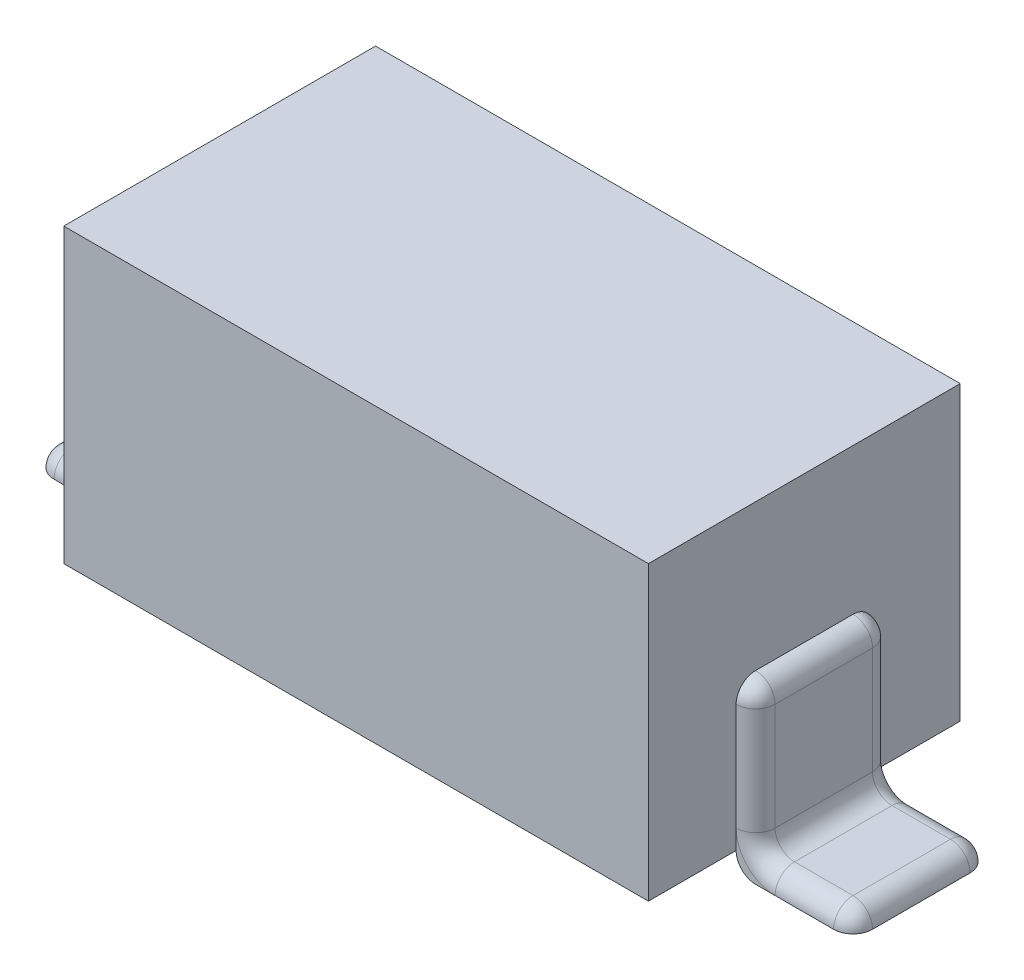
ISO-10303-21;
HEADER;
FILE_DESCRIPTION(('STEP AP214'),'2;1');
FILE_NAME('part.step','',(''),(''),'','','');
FILE_SCHEMA(('AUTOMOTIVE_DESIGN { 1 0 10303 214 1 1 1 1 }'));
ENDSEC;
DATA;
#1=APPLICATION_CONTEXT('core data for automotive mechanical design processes');
#2=APPLICATION_PROTOCOL_DEFINITION('international standard','automotive_design',2000,#1);
#3=PRODUCT_CONTEXT('',#1,'mechanical');
#4=PRODUCT('Part','Part','',(#3));
#5=PRODUCT_RELATED_PRODUCT_CATEGORY('part','',(#4));
#6=PRODUCT_DEFINITION_FORMATION('','',#4);
#7=PRODUCT_DEFINITION_CONTEXT('part definition',#1,'design');
#8=PRODUCT_DEFINITION('design','',#6,#7);
#9=PRODUCT_DEFINITION_SHAPE('','',#8);
#10=(LENGTH_UNIT() NAMED_UNIT(*) SI_UNIT(.MILLI.,.METRE.));
#11=(NAMED_UNIT(*) PLANE_ANGLE_UNIT() SI_UNIT($,.RADIAN.));
#12=(NAMED_UNIT(*) SI_UNIT($,.STERADIAN.) SOLID_ANGLE_UNIT());
#13=UNCERTAINTY_MEASURE_WITH_UNIT(LENGTH_MEASURE(1.E-05),#10,'distance_accuracy_value','');
#14=(GEOMETRIC_REPRESENTATION_CONTEXT(3) GLOBAL_UNCERTAINTY_ASSIGNED_CONTEXT((#13)) GLOBAL_UNIT_ASSIGNED_CONTEXT((#10,
#11,#12)) REPRESENTATION_CONTEXT('',''));
#15=CARTESIAN_POINT('',(0.,0.,0.));
#16=DIRECTION('',(0.,0.,1.));
#17=DIRECTION('',(1.,0.,0.));
#18=AXIS2_PLACEMENT_3D('',#15,#16,#17);
#19=CARTESIAN_POINT('',(-1.6,-0.85,0.35));
#20=DIRECTION('',(0.,0.,1.));
#21=DIRECTION('',(1.,0.,0.));
#22=AXIS2_PLACEMENT_3D('',#19,#20,#21);
#23=PLANE('',#22);
#24=DIRECTION('',(1.,0.,0.));
#25=VECTOR('',#24,1.);
#26=CARTESIAN_POINT('',(-1.6,-0.85,0.35));
#27=LINE('',#26,#25);
#28=CARTESIAN_POINT('',(-1.7,-0.85,0.35));
#29=VERTEX_POINT('',#28);
#30=CARTESIAN_POINT('',(-1.6,-0.85,0.35));
#31=VERTEX_POINT('',#30);
#32=EDGE_CURVE('E306',#29,#31,#27,.T.);
#33=ORIENTED_EDGE('',*,*,#32,.T.);
#34=CARTESIAN_POINT('',(-1.6,-0.75,0.35));
#35=DIRECTION('',(0.,0.,1.));
#36=DIRECTION('',(1.,0.,0.));
#37=AXIS2_PLACEMENT_3D('',#34,#35,#36);
#38=CIRCLE('',#37,0.1);
#39=CARTESIAN_POINT('',(-1.5,-0.75,0.35));
#40=VERTEX_POINT('',#39);
#41=EDGE_CURVE('E377',#31,#40,#38,.T.);
#42=ORIENTED_EDGE('',*,*,#41,.T.);
#43=DIRECTION('',(0.,-1.,0.));
#44=VECTOR('',#43,1.);
#45=CARTESIAN_POINT('',(-1.5,-0.85,0.35));
#46=LINE('',#45,#44);
#47=CARTESIAN_POINT('',(-1.5,-0.65,0.35));
#48=VERTEX_POINT('',#47);
#49=EDGE_CURVE('E311',#48,#40,#46,.T.);
#50=ORIENTED_EDGE('',*,*,#49,.F.);
#51=CARTESIAN_POINT('',(-1.7,-0.65,0.35));
#52=DIRECTION('',(0.,0.,1.));
#53=DIRECTION('',(1.,0.,0.));
#54=AXIS2_PLACEMENT_3D('',#51,#52,#53);
#55=CIRCLE('',#54,0.2);
#56=EDGE_CURVE('E379',#29,#48,#55,.T.);
#57=ORIENTED_EDGE('',*,*,#56,.F.);
#58=EDGE_LOOP('',(#33,#42,#50,#57));
#59=FACE_BOUND('',#58,.T.);
#60=ADVANCED_FACE('F37',(#59),#23,.T.);
#61=CARTESIAN_POINT('',(-1.6,-0.85,-0.35));
#62=DIRECTION('',(0.,0.,-1.));
#63=DIRECTION('',(-1.,0.,0.));
#64=AXIS2_PLACEMENT_3D('',#61,#62,#63);
#65=PLANE('',#64);
#66=CARTESIAN_POINT('',(-1.7,-0.65,-0.35));
#67=DIRECTION('',(0.,0.,-1.));
#68=DIRECTION('',(-1.,0.,0.));
#69=AXIS2_PLACEMENT_3D('',#66,#67,#68);
#70=CIRCLE('',#69,0.2);
#71=CARTESIAN_POINT('',(-1.5,-0.65,-0.35));
#72=VERTEX_POINT('',#71);
#73=CARTESIAN_POINT('',(-1.7,-0.85,-0.35));
#74=VERTEX_POINT('',#73);
#75=EDGE_CURVE('E229',#72,#74,#70,.T.);
#76=ORIENTED_EDGE('',*,*,#75,.F.);
#77=DIRECTION('',(0.,1.,0.));
#78=VECTOR('',#77,1.);
#79=CARTESIAN_POINT('',(-1.5,-0.85,-0.35));
#80=LINE('',#79,#78);
#81=CARTESIAN_POINT('',(-1.5,-0.75,-0.35));
#82=VERTEX_POINT('',#81);
#83=EDGE_CURVE('E230',#82,#72,#80,.T.);
#84=ORIENTED_EDGE('',*,*,#83,.F.);
#85=CARTESIAN_POINT('',(-1.6,-0.75,-0.35));
#86=DIRECTION('',(0.,0.,-1.));
#87=DIRECTION('',(-1.,0.,0.));
#88=AXIS2_PLACEMENT_3D('',#85,#86,#87);
#89=CIRCLE('',#88,0.1);
#90=CARTESIAN_POINT('',(-1.6,-0.85,-0.35));
#91=VERTEX_POINT('',#90);
#92=EDGE_CURVE('E220',#82,#91,#89,.T.);
#93=ORIENTED_EDGE('',*,*,#92,.T.);
#94=DIRECTION('',(1.,0.,0.));
#95=VECTOR('',#94,1.);
#96=CARTESIAN_POINT('',(-1.6,-0.85,-0.35));
#97=LINE('',#96,#95);
#98=EDGE_CURVE('E302',#74,#91,#97,.T.);
#99=ORIENTED_EDGE('',*,*,#98,.F.);
#100=EDGE_LOOP('',(#76,#84,#93,#99));
#101=FACE_BOUND('',#100,.T.);
#102=ADVANCED_FACE('F233',(#101),#65,.T.);
#103=CARTESIAN_POINT('',(1.6,-0.85,0.35));
#104=DIRECTION('',(0.,0.,-1.));
#105=DIRECTION('',(-1.,0.,0.));
#106=AXIS2_PLACEMENT_3D('',#103,#104,#105);
#107=PLANE('',#106);
#108=CARTESIAN_POINT('',(1.7,-0.65,0.35));
#109=DIRECTION('',(0.,0.,-1.));
#110=DIRECTION('',(-1.,0.,0.));
#111=AXIS2_PLACEMENT_3D('',#108,#109,#110);
#112=CIRCLE('',#111,0.2);
#113=CARTESIAN_POINT('',(1.5,-0.65,0.35));
#114=VERTEX_POINT('',#113);
#115=CARTESIAN_POINT('',(1.7,-0.85,0.35));
#116=VERTEX_POINT('',#115);
#117=EDGE_CURVE('E449',#114,#116,#112,.F.);
#118=ORIENTED_EDGE('',*,*,#117,.F.);
#119=DIRECTION('',(0.,-1.,0.));
#120=VECTOR('',#119,1.);
#121=CARTESIAN_POINT('',(1.5,-0.85,0.35));
#122=LINE('',#121,#120);
#123=CARTESIAN_POINT('',(1.5,-0.75,0.35));
#124=VERTEX_POINT('',#123);
#125=EDGE_CURVE('E288',#114,#124,#122,.T.);
#126=ORIENTED_EDGE('',*,*,#125,.T.);
#127=CARTESIAN_POINT('',(1.6,-0.75,0.35));
#128=DIRECTION('',(0.,0.,-1.));
#129=DIRECTION('',(-1.,0.,0.));
#130=AXIS2_PLACEMENT_3D('',#127,#128,#129);
#131=CIRCLE('',#130,0.1);
#132=CARTESIAN_POINT('',(1.6,-0.85,0.35));
#133=VERTEX_POINT('',#132);
#134=EDGE_CURVE('E452',#124,#133,#131,.F.);
#135=ORIENTED_EDGE('',*,*,#134,.T.);
#136=DIRECTION('',(-1.,0.,0.));
#137=VECTOR('',#136,1.);
#138=CARTESIAN_POINT('',(1.6,-0.85,0.35));
#139=LINE('',#138,#137);
#140=EDGE_CURVE('E279',#116,#133,#139,.T.);
#141=ORIENTED_EDGE('',*,*,#140,.F.);
#142=EDGE_LOOP('',(#118,#126,#135,#141));
#143=FACE_BOUND('',#142,.T.);
#144=ADVANCED_FACE('F504',(#143),#107,.F.);
#145=CARTESIAN_POINT('',(1.6,-0.85,-0.35));
#146=DIRECTION('',(0.,0.,1.));
#147=DIRECTION('',(1.,0.,0.));
#148=AXIS2_PLACEMENT_3D('',#145,#146,#147);
#149=PLANE('',#148);
#150=DIRECTION('',(-1.,0.,0.));
#151=VECTOR('',#150,1.);
#152=CARTESIAN_POINT('',(1.6,-0.85,-0.35));
#153=LINE('',#152,#151);
#154=CARTESIAN_POINT('',(1.7,-0.85,-0.35));
#155=VERTEX_POINT('',#154);
#156=CARTESIAN_POINT('',(1.6,-0.85,-0.35));
#157=VERTEX_POINT('',#156);
#158=EDGE_CURVE('E284',#155,#157,#153,.T.);
#159=ORIENTED_EDGE('',*,*,#158,.T.);
#160=CARTESIAN_POINT('',(1.6,-0.75,-0.35));
#161=DIRECTION('',(0.,0.,1.));
#162=DIRECTION('',(1.,0.,0.));
#163=AXIS2_PLACEMENT_3D('',#160,#161,#162);
#164=CIRCLE('',#163,0.1);
#165=CARTESIAN_POINT('',(1.5,-0.75,-0.35));
#166=VERTEX_POINT('',#165);
#167=EDGE_CURVE('E454',#157,#166,#164,.F.);
#168=ORIENTED_EDGE('',*,*,#167,.T.);
#169=DIRECTION('',(0.,1.,0.));
#170=VECTOR('',#169,1.);
#171=CARTESIAN_POINT('',(1.5,-0.85,-0.35));
#172=LINE('',#171,#170);
#173=CARTESIAN_POINT('',(1.5,-0.65,-0.35));
#174=VERTEX_POINT('',#173);
#175=EDGE_CURVE('E297',#166,#174,#172,.T.);
#176=ORIENTED_EDGE('',*,*,#175,.T.);
#177=CARTESIAN_POINT('',(1.7,-0.65,-0.35));
#178=DIRECTION('',(0.,0.,1.));
#179=DIRECTION('',(1.,0.,0.));
#180=AXIS2_PLACEMENT_3D('',#177,#178,#179);
#181=CIRCLE('',#180,0.2);
#182=EDGE_CURVE('E456',#155,#174,#181,.F.);
#183=ORIENTED_EDGE('',*,*,#182,.F.);
#184=EDGE_LOOP('',(#159,#168,#176,#183));
#185=FACE_BOUND('',#184,.T.);
#186=ADVANCED_FACE('F528',(#185),#149,.F.);
#187=CARTESIAN_POINT('',(1.6,0.,0.));
#188=DIRECTION('',(-1.,0.,0.));
#189=DIRECTION('',(0.,0.,1.));
#190=AXIS2_PLACEMENT_3D('',#187,#188,#189);
#191=PLANE('',#190);
#192=DIRECTION('',(0.,0.,1.));
#193=VECTOR('',#192,1.);
#194=CARTESIAN_POINT('',(1.6,-0.65,-0.35));
#195=LINE('',#194,#193);
#196=CARTESIAN_POINT('',(1.6,-0.65,0.25));
#197=VERTEX_POINT('',#196);
#198=CARTESIAN_POINT('',(1.6,-0.65,-0.25));
#199=VERTEX_POINT('',#198);
#200=EDGE_CURVE('E436',#197,#199,#195,.F.);
#201=ORIENTED_EDGE('',*,*,#200,.T.);
#202=DIRECTION('',(0.,1.,0.));
#203=VECTOR('',#202,1.);
#204=CARTESIAN_POINT('',(1.6,0.,-0.25));
#205=LINE('',#204,#203);
#206=CARTESIAN_POINT('',(1.6,-0.1,-0.25));
#207=VERTEX_POINT('',#206);
#208=EDGE_CURVE('E433',#199,#207,#205,.T.);
#209=ORIENTED_EDGE('',*,*,#208,.T.);
#210=DIRECTION('',(0.,0.,1.));
#211=VECTOR('',#210,1.);
#212=CARTESIAN_POINT('',(1.6,-0.1,0.));
#213=LINE('',#212,#211);
#214=CARTESIAN_POINT('',(1.6,-0.1,0.25));
#215=VERTEX_POINT('',#214);
#216=EDGE_CURVE('E438',#207,#215,#213,.T.);
#217=ORIENTED_EDGE('',*,*,#216,.T.);
#218=DIRECTION('',(0.,-1.,0.));
#219=VECTOR('',#218,1.);
#220=CARTESIAN_POINT('',(1.6,0.,0.25));
#221=LINE('',#220,#219);
#222=EDGE_CURVE('E440',#215,#197,#221,.T.);
#223=ORIENTED_EDGE('',*,*,#222,.T.);
#224=EDGE_LOOP('',(#201,#209,#217,#223));
#225=FACE_BOUND('',#224,.T.);
#226=ADVANCED_FACE('F580',(#225),#191,.F.);
#227=CARTESIAN_POINT('',(1.5,0.75,0.8));
#228=DIRECTION('',(-1.,0.,0.));
#229=DIRECTION('',(0.,0.,1.));
#230=AXIS2_PLACEMENT_3D('',#227,#228,#229);
#231=PLANE('',#230);
#232=ORIENTED_EDGE('',*,*,#175,.F.);
#233=DIRECTION('',(0.,0.,-1.));
#234=VECTOR('',#233,1.);
#235=CARTESIAN_POINT('',(1.5,-0.75,0.8));
#236=LINE('',#235,#234);
#237=CARTESIAN_POINT('',(1.5,-0.75,-0.8));
#238=VERTEX_POINT('',#237);
#239=EDGE_CURVE('E268',#166,#238,#236,.T.);
#240=ORIENTED_EDGE('',*,*,#239,.T.);
#241=DIRECTION('',(0.,-1.,0.));
#242=VECTOR('',#241,1.);
#243=CARTESIAN_POINT('',(1.5,0.75,-0.8));
#244=LINE('',#243,#242);
#245=CARTESIAN_POINT('',(1.5,0.75,-0.8));
#246=VERTEX_POINT('',#245);
#247=EDGE_CURVE('E298',#246,#238,#244,.T.);
#248=ORIENTED_EDGE('',*,*,#247,.F.);
#249=DIRECTION('',(0.,0.,-1.));
#250=VECTOR('',#249,1.);
#251=CARTESIAN_POINT('',(1.5,0.75,0.8));
#252=LINE('',#251,#250);
#253=CARTESIAN_POINT('',(1.5,0.75,0.8));
#254=VERTEX_POINT('',#253);
#255=EDGE_CURVE('E255',#254,#246,#252,.T.);
#256=ORIENTED_EDGE('',*,*,#255,.F.);
#257=DIRECTION('',(0.,-1.,0.));
#258=VECTOR('',#257,1.);
#259=CARTESIAN_POINT('',(1.5,0.75,0.8));
#260=LINE('',#259,#258);
#261=CARTESIAN_POINT('',(1.5,-0.75,0.8));
#262=VERTEX_POINT('',#261);
#263=EDGE_CURVE('E272',#254,#262,#260,.T.);
#264=ORIENTED_EDGE('',*,*,#263,.T.);
#265=EDGE_CURVE('E262',#262,#124,#236,.T.);
#266=ORIENTED_EDGE('',*,*,#265,.T.);
#267=ORIENTED_EDGE('',*,*,#125,.F.);
#268=CARTESIAN_POINT('',(1.5,-0.1,0.35));
#269=VERTEX_POINT('',#268);
#270=EDGE_CURVE('E287',#269,#114,#122,.T.);
#271=ORIENTED_EDGE('',*,*,#270,.F.);
#272=CARTESIAN_POINT('',(1.5,-0.1,0.25));
#273=DIRECTION('',(-1.,0.,0.));
#274=DIRECTION('',(0.,0.,1.));
#275=AXIS2_PLACEMENT_3D('',#272,#273,#274);
#276=CIRCLE('',#275,0.1);
#277=CARTESIAN_POINT('',(1.5,0.,0.25));
#278=VERTEX_POINT('',#277);
#279=EDGE_CURVE('E314',#269,#278,#276,.T.);
#280=ORIENTED_EDGE('',*,*,#279,.T.);
#281=DIRECTION('',(0.,0.,1.));
#282=VECTOR('',#281,1.);
#283=CARTESIAN_POINT('',(1.5,0.,0.35));
#284=LINE('',#283,#282);
#285=CARTESIAN_POINT('',(1.5,0.,-0.25));
#286=VERTEX_POINT('',#285);
#287=EDGE_CURVE('E290',#286,#278,#284,.T.);
#288=ORIENTED_EDGE('',*,*,#287,.F.);
#289=CARTESIAN_POINT('',(1.5,-0.1,-0.25));
#290=DIRECTION('',(-1.,0.,0.));
#291=DIRECTION('',(0.,0.,1.));
#292=AXIS2_PLACEMENT_3D('',#289,#290,#291);
#293=CIRCLE('',#292,0.1);
#294=CARTESIAN_POINT('',(1.5,-0.1,-0.35));
#295=VERTEX_POINT('',#294);
#296=EDGE_CURVE('E431',#286,#295,#293,.T.);
#297=ORIENTED_EDGE('',*,*,#296,.T.);
#298=EDGE_CURVE('E294',#174,#295,#172,.T.);
#299=ORIENTED_EDGE('',*,*,#298,.F.);
#300=EDGE_LOOP('',(#232,#240,#248,#256,#264,#266,#267,#271,#280,#288,#297,#299));
#301=FACE_BOUND('',#300,.T.);
#302=ADVANCED_FACE('F477',(#301),#231,.F.);
#303=CARTESIAN_POINT('',(-1.5,0.75,-0.8));
#304=DIRECTION('',(0.,0.,1.));
#305=DIRECTION('',(1.,0.,0.));
#306=AXIS2_PLACEMENT_3D('',#303,#304,#305);
#307=PLANE('',#306);
#308=DIRECTION('',(-1.,0.,0.));
#309=VECTOR('',#308,1.);
#310=CARTESIAN_POINT('',(-1.5,-0.75,-0.8));
#311=LINE('',#310,#309);
#312=CARTESIAN_POINT('',(-1.5,-0.75,-0.8));
#313=VERTEX_POINT('',#312);
#314=EDGE_CURVE('E258',#238,#313,#311,.T.);
#315=ORIENTED_EDGE('',*,*,#314,.T.);
#316=DIRECTION('',(0.,-1.,0.));
#317=VECTOR('',#316,1.);
#318=CARTESIAN_POINT('',(-1.5,0.75,-0.8));
#319=LINE('',#318,#317);
#320=CARTESIAN_POINT('',(-1.5,0.75,-0.8));
#321=VERTEX_POINT('',#320);
#322=EDGE_CURVE('E253',#321,#313,#319,.T.);
#323=ORIENTED_EDGE('',*,*,#322,.F.);
#324=DIRECTION('',(-1.,0.,0.));
#325=VECTOR('',#324,1.);
#326=CARTESIAN_POINT('',(-1.5,0.75,-0.8));
#327=LINE('',#326,#325);
#328=EDGE_CURVE('E275',#246,#321,#327,.T.);
#329=ORIENTED_EDGE('',*,*,#328,.F.);
#330=ORIENTED_EDGE('',*,*,#247,.T.);
#331=EDGE_LOOP('',(#315,#323,#329,#330));
#332=FACE_BOUND('',#331,.T.);
#333=ADVANCED_FACE('F601',(#332),#307,.F.);
#334=CARTESIAN_POINT('',(-1.5,0.75,0.8));
#335=DIRECTION('',(1.,0.,0.));
#336=DIRECTION('',(0.,0.,-1.));
#337=AXIS2_PLACEMENT_3D('',#334,#335,#336);
#338=PLANE('',#337);
#339=DIRECTION('',(0.,0.,1.));
#340=VECTOR('',#339,1.);
#341=CARTESIAN_POINT('',(-1.5,-0.75,0.8));
#342=LINE('',#341,#340);
#343=EDGE_CURVE('E245',#313,#82,#342,.T.);
#344=ORIENTED_EDGE('',*,*,#343,.T.);
#345=ORIENTED_EDGE('',*,*,#83,.T.);
#346=CARTESIAN_POINT('',(-1.5,-0.1,-0.35));
#347=VERTEX_POINT('',#346);
#348=EDGE_CURVE('E237',#72,#347,#80,.T.);
#349=ORIENTED_EDGE('',*,*,#348,.T.);
#350=CARTESIAN_POINT('',(-1.5,-0.1,-0.25));
#351=DIRECTION('',(1.,0.,0.));
#352=DIRECTION('',(0.,0.,-1.));
#353=AXIS2_PLACEMENT_3D('',#350,#351,#352);
#354=CIRCLE('',#353,0.1);
#355=CARTESIAN_POINT('',(-1.5,0.,-0.25));
#356=VERTEX_POINT('',#355);
#357=EDGE_CURVE('E46',#347,#356,#354,.T.);
#358=ORIENTED_EDGE('',*,*,#357,.T.);
#359=DIRECTION('',(0.,0.,1.));
#360=VECTOR('',#359,1.);
#361=CARTESIAN_POINT('',(-1.5,0.,0.35));
#362=LINE('',#361,#360);
#363=CARTESIAN_POINT('',(-1.5,0.,0.25));
#364=VERTEX_POINT('',#363);
#365=EDGE_CURVE('E53',#356,#364,#362,.T.);
#366=ORIENTED_EDGE('',*,*,#365,.T.);
#367=CARTESIAN_POINT('',(-1.5,-0.1,0.25));
#368=DIRECTION('',(1.,0.,0.));
#369=DIRECTION('',(0.,0.,-1.));
#370=AXIS2_PLACEMENT_3D('',#367,#368,#369);
#371=CIRCLE('',#370,0.1);
#372=CARTESIAN_POINT('',(-1.5,-0.1,0.35));
#373=VERTEX_POINT('',#372);
#374=EDGE_CURVE('E11',#364,#373,#371,.T.);
#375=ORIENTED_EDGE('',*,*,#374,.T.);
#376=EDGE_CURVE('E310',#373,#48,#46,.T.);
#377=ORIENTED_EDGE('',*,*,#376,.T.);
#378=ORIENTED_EDGE('',*,*,#49,.T.);
#379=CARTESIAN_POINT('',(-1.5,-0.75,0.8));
#380=VERTEX_POINT('',#379);
#381=EDGE_CURVE('E247',#40,#380,#342,.T.);
#382=ORIENTED_EDGE('',*,*,#381,.T.);
#383=DIRECTION('',(0.,-1.,0.));
#384=VECTOR('',#383,1.);
#385=CARTESIAN_POINT('',(-1.5,0.75,0.8));
#386=LINE('',#385,#384);
#387=CARTESIAN_POINT('',(-1.5,0.75,0.8));
#388=VERTEX_POINT('',#387);
#389=EDGE_CURVE('E470',#388,#380,#386,.T.);
#390=ORIENTED_EDGE('',*,*,#389,.F.);
#391=DIRECTION('',(0.,0.,1.));
#392=VECTOR('',#391,1.);
#393=CARTESIAN_POINT('',(-1.5,0.75,0.8));
#394=LINE('',#393,#392);
#395=EDGE_CURVE('E273',#321,#388,#394,.T.);
#396=ORIENTED_EDGE('',*,*,#395,.F.);
#397=ORIENTED_EDGE('',*,*,#322,.T.);
#398=EDGE_LOOP('',(#344,#345,#349,#358,#366,#375,#377,#378,#382,#390,#396,#397));
#399=FACE_BOUND('',#398,.T.);
#400=ADVANCED_FACE('F250',(#399),#338,.F.);
#401=CARTESIAN_POINT('',(-1.5,0.75,0.8));
#402=DIRECTION('',(0.,0.,-1.));
#403=DIRECTION('',(-1.,0.,0.));
#404=AXIS2_PLACEMENT_3D('',#401,#402,#403);
#405=PLANE('',#404);
#406=DIRECTION('',(1.,0.,0.));
#407=VECTOR('',#406,1.);
#408=CARTESIAN_POINT('',(-1.5,-0.75,0.8));
#409=LINE('',#408,#407);
#410=EDGE_CURVE('E254',#380,#262,#409,.T.);
#411=ORIENTED_EDGE('',*,*,#410,.T.);
#412=ORIENTED_EDGE('',*,*,#263,.F.);
#413=DIRECTION('',(1.,0.,0.));
#414=VECTOR('',#413,1.);
#415=CARTESIAN_POINT('',(-1.5,0.75,0.8));
#416=LINE('',#415,#414);
#417=EDGE_CURVE('E270',#388,#254,#416,.T.);
#418=ORIENTED_EDGE('',*,*,#417,.F.);
#419=ORIENTED_EDGE('',*,*,#389,.T.);
#420=EDGE_LOOP('',(#411,#412,#418,#419));
#421=FACE_BOUND('',#420,.T.);
#422=ADVANCED_FACE('F593',(#421),#405,.F.);
#423=CARTESIAN_POINT('',(0.,0.75,0.));
#424=DIRECTION('',(0.,-1.,0.));
#425=DIRECTION('',(0.,0.,-1.));
#426=AXIS2_PLACEMENT_3D('',#423,#424,#425);
#427=PLANE('',#426);
#428=ORIENTED_EDGE('',*,*,#255,.T.);
#429=ORIENTED_EDGE('',*,*,#328,.T.);
#430=ORIENTED_EDGE('',*,*,#395,.T.);
#431=ORIENTED_EDGE('',*,*,#417,.T.);
#432=EDGE_LOOP('',(#428,#429,#430,#431));
#433=FACE_BOUND('',#432,.T.);
#434=ADVANCED_FACE('F590',(#433),#427,.F.);
#435=CARTESIAN_POINT('',(0.,-0.75,0.));
#436=DIRECTION('',(0.,-1.,0.));
#437=DIRECTION('',(0.,0.,-1.));
#438=AXIS2_PLACEMENT_3D('',#435,#436,#437);
#439=PLANE('',#438);
#440=ORIENTED_EDGE('',*,*,#265,.F.);
#441=ORIENTED_EDGE('',*,*,#410,.F.);
#442=ORIENTED_EDGE('',*,*,#381,.F.);
#443=EDGE_CURVE('E224',#82,#40,#342,.T.);
#444=ORIENTED_EDGE('',*,*,#443,.F.);
#445=ORIENTED_EDGE('',*,*,#343,.F.);
#446=ORIENTED_EDGE('',*,*,#314,.F.);
#447=ORIENTED_EDGE('',*,*,#239,.F.);
#448=EDGE_CURVE('E266',#124,#166,#236,.T.);
#449=ORIENTED_EDGE('',*,*,#448,.F.);
#450=EDGE_LOOP('',(#440,#441,#442,#444,#445,#446,#447,#449));
#451=FACE_BOUND('',#450,.T.);
#452=ADVANCED_FACE('F243',(#451),#439,.T.);
#453=CARTESIAN_POINT('',(1.6,-0.85,0.35));
#454=DIRECTION('',(0.,1.,0.));
#455=DIRECTION('',(0.,0.,1.));
#456=AXIS2_PLACEMENT_3D('',#453,#454,#455);
#457=PLANE('',#456);
#458=CARTESIAN_POINT('',(2.,-0.85,-0.35));
#459=VERTEX_POINT('',#458);
#460=EDGE_CURVE('E283',#459,#155,#153,.T.);
#461=ORIENTED_EDGE('',*,*,#460,.F.);
#462=CARTESIAN_POINT('',(2.,-0.85,-0.25));
#463=DIRECTION('',(0.,1.,0.));
#464=DIRECTION('',(0.,0.,1.));
#465=AXIS2_PLACEMENT_3D('',#462,#463,#464);
#466=CIRCLE('',#465,0.1);
#467=CARTESIAN_POINT('',(2.1,-0.85,-0.25));
#468=VERTEX_POINT('',#467);
#469=EDGE_CURVE('E442',#459,#468,#466,.F.);
#470=ORIENTED_EDGE('',*,*,#469,.T.);
#471=DIRECTION('',(0.,0.,-1.));
#472=VECTOR('',#471,1.);
#473=CARTESIAN_POINT('',(2.1,-0.85,0.35));
#474=LINE('',#473,#472);
#475=CARTESIAN_POINT('',(2.1,-0.85,0.25));
#476=VERTEX_POINT('',#475);
#477=EDGE_CURVE('E293',#476,#468,#474,.T.);
#478=ORIENTED_EDGE('',*,*,#477,.F.);
#479=CARTESIAN_POINT('',(2.,-0.85,0.25));
#480=DIRECTION('',(0.,1.,0.));
#481=DIRECTION('',(0.,0.,1.));
#482=AXIS2_PLACEMENT_3D('',#479,#480,#481);
#483=CIRCLE('',#482,0.1);
#484=CARTESIAN_POINT('',(2.,-0.85,0.35));
#485=VERTEX_POINT('',#484);
#486=EDGE_CURVE('E444',#476,#485,#483,.F.);
#487=ORIENTED_EDGE('',*,*,#486,.T.);
#488=EDGE_CURVE('E282',#485,#116,#139,.T.);
#489=ORIENTED_EDGE('',*,*,#488,.T.);
#490=ORIENTED_EDGE('',*,*,#140,.T.);
#491=DIRECTION('',(0.,0.,-1.));
#492=VECTOR('',#491,1.);
#493=CARTESIAN_POINT('',(1.6,-0.85,-0.35));
#494=LINE('',#493,#492);
#495=EDGE_CURVE('E446',#133,#157,#494,.T.);
#496=ORIENTED_EDGE('',*,*,#495,.T.);
#497=ORIENTED_EDGE('',*,*,#158,.F.);
#498=EDGE_LOOP('',(#461,#470,#478,#487,#489,#490,#496,#497));
#499=FACE_BOUND('',#498,.T.);
#500=ADVANCED_FACE('F492',(#499),#457,.F.);
#501=CARTESIAN_POINT('',(2.1,-0.75,0.35));
#502=DIRECTION('',(0.,-1.,0.));
#503=DIRECTION('',(0.,0.,-1.));
#504=AXIS2_PLACEMENT_3D('',#501,#502,#503);
#505=PLANE('',#504);
#506=DIRECTION('',(-1.,0.,0.));
#507=VECTOR('',#506,1.);
#508=CARTESIAN_POINT('',(2.1,-0.75,0.25));
#509=LINE('',#508,#507);
#510=CARTESIAN_POINT('',(1.7,-0.75,0.25));
#511=VERTEX_POINT('',#510);
#512=CARTESIAN_POINT('',(2.,-0.75,0.25));
#513=VERTEX_POINT('',#512);
#514=EDGE_CURVE('E464',#511,#513,#509,.F.);
#515=ORIENTED_EDGE('',*,*,#514,.T.);
#516=DIRECTION('',(0.,0.,1.));
#517=VECTOR('',#516,1.);
#518=CARTESIAN_POINT('',(2.,-0.75,0.35));
#519=LINE('',#518,#517);
#520=CARTESIAN_POINT('',(2.,-0.75,-0.25));
#521=VERTEX_POINT('',#520);
#522=EDGE_CURVE('E459',#513,#521,#519,.F.);
#523=ORIENTED_EDGE('',*,*,#522,.T.);
#524=DIRECTION('',(-1.,0.,0.));
#525=VECTOR('',#524,1.);
#526=CARTESIAN_POINT('',(2.1,-0.75,-0.25));
#527=LINE('',#526,#525);
#528=CARTESIAN_POINT('',(1.7,-0.75,-0.25));
#529=VERTEX_POINT('',#528);
#530=EDGE_CURVE('E461',#521,#529,#527,.T.);
#531=ORIENTED_EDGE('',*,*,#530,.T.);
#532=DIRECTION('',(0.,0.,1.));
#533=VECTOR('',#532,1.);
#534=CARTESIAN_POINT('',(1.7,-0.75,0.35));
#535=LINE('',#534,#533);
#536=EDGE_CURVE('E466',#529,#511,#535,.T.);
#537=ORIENTED_EDGE('',*,*,#536,.T.);
#538=EDGE_LOOP('',(#515,#523,#531,#537));
#539=FACE_BOUND('',#538,.T.);
#540=ADVANCED_FACE('F546',(#539),#505,.F.);
#541=CARTESIAN_POINT('',(1.5,-0.1,0.25));
#542=DIRECTION('',(0.,0.,1.));
#543=DIRECTION('',(1.,0.,0.));
#544=AXIS2_PLACEMENT_3D('',#541,#542,#543);
#545=SPHERICAL_SURFACE('',#544,0.1);
#546=CARTESIAN_POINT('',(1.5,-0.1,0.25));
#547=DIRECTION('',(0.,0.,1.));
#548=DIRECTION('',(1.,0.,0.));
#549=AXIS2_PLACEMENT_3D('',#546,#547,#548);
#550=CIRCLE('',#549,0.1);
#551=EDGE_CURVE('E394',#278,#215,#550,.F.);
#552=ORIENTED_EDGE('',*,*,#551,.F.);
#553=ORIENTED_EDGE('',*,*,#279,.F.);
#554=CARTESIAN_POINT('',(1.5,-0.1,0.25));
#555=DIRECTION('',(0.,1.,0.));
#556=DIRECTION('',(-1.,0.,0.));
#557=AXIS2_PLACEMENT_3D('',#554,#555,#556);
#558=CIRCLE('',#557,0.1);
#559=EDGE_CURVE('E301',#215,#269,#558,.F.);
#560=ORIENTED_EDGE('',*,*,#559,.F.);
#561=EDGE_LOOP('',(#552,#553,#560));
#562=FACE_BOUND('',#561,.T.);
#563=ADVANCED_FACE('F513',(#562),#545,.T.);
#564=CARTESIAN_POINT('',(1.6,-0.85,0.25));
#565=DIRECTION('',(-1.,0.,0.));
#566=DIRECTION('',(0.,0.,1.));
#567=AXIS2_PLACEMENT_3D('',#564,#565,#566);
#568=CYLINDRICAL_SURFACE('',#567,0.1);
#569=CARTESIAN_POINT('',(1.7,-0.85,0.25));
#570=DIRECTION('',(-1.,0.,0.));
#571=DIRECTION('',(0.,0.,1.));
#572=AXIS2_PLACEMENT_3D('',#569,#570,#571);
#573=CIRCLE('',#572,0.1);
#574=EDGE_CURVE('E400',#116,#511,#573,.T.);
#575=ORIENTED_EDGE('',*,*,#574,.F.);
#576=ORIENTED_EDGE('',*,*,#488,.F.);
#577=CARTESIAN_POINT('',(2.,-0.85,0.25));
#578=DIRECTION('',(1.,0.,0.));
#579=DIRECTION('',(0.,0.,-1.));
#580=AXIS2_PLACEMENT_3D('',#577,#578,#579);
#581=CIRCLE('',#580,0.1);
#582=EDGE_CURVE('E397',#513,#485,#581,.T.);
#583=ORIENTED_EDGE('',*,*,#582,.F.);
#584=ORIENTED_EDGE('',*,*,#514,.F.);
#585=EDGE_LOOP('',(#575,#576,#583,#584));
#586=FACE_BOUND('',#585,.T.);
#587=ADVANCED_FACE('F498',(#586),#568,.T.);
#588=CARTESIAN_POINT('',(1.5,0.,0.25));
#589=DIRECTION('',(0.,-1.,0.));
#590=DIRECTION('',(0.,0.,-1.));
#591=AXIS2_PLACEMENT_3D('',#588,#589,#590);
#592=CYLINDRICAL_SURFACE('',#591,0.1);
#593=ORIENTED_EDGE('',*,*,#559,.T.);
#594=ORIENTED_EDGE('',*,*,#270,.T.);
#595=CARTESIAN_POINT('',(1.5,-0.65,0.25));
#596=DIRECTION('',(0.,-1.,0.));
#597=DIRECTION('',(0.,0.,-1.));
#598=AXIS2_PLACEMENT_3D('',#595,#596,#597);
#599=CIRCLE('',#598,0.1);
#600=EDGE_CURVE('E403',#197,#114,#599,.T.);
#601=ORIENTED_EDGE('',*,*,#600,.F.);
#602=ORIENTED_EDGE('',*,*,#222,.F.);
#603=EDGE_LOOP('',(#593,#594,#601,#602));
#604=FACE_BOUND('',#603,.T.);
#605=ADVANCED_FACE('F508',(#604),#592,.T.);
#606=CARTESIAN_POINT('',(1.5,-0.1,0.));
#607=DIRECTION('',(0.,0.,1.));
#608=DIRECTION('',(1.,0.,0.));
#609=AXIS2_PLACEMENT_3D('',#606,#607,#608);
#610=CYLINDRICAL_SURFACE('',#609,0.1);
#611=ORIENTED_EDGE('',*,*,#551,.T.);
#612=ORIENTED_EDGE('',*,*,#216,.F.);
#613=CARTESIAN_POINT('',(1.5,-0.1,-0.25));
#614=DIRECTION('',(0.,0.,-1.));
#615=DIRECTION('',(-1.,0.,0.));
#616=AXIS2_PLACEMENT_3D('',#613,#614,#615);
#617=CIRCLE('',#616,0.1);
#618=EDGE_CURVE('E406',#286,#207,#617,.T.);
#619=ORIENTED_EDGE('',*,*,#618,.F.);
#620=ORIENTED_EDGE('',*,*,#287,.T.);
#621=EDGE_LOOP('',(#611,#612,#619,#620));
#622=FACE_BOUND('',#621,.T.);
#623=ADVANCED_FACE('F519',(#622),#610,.T.);
#624=CARTESIAN_POINT('',(2.,-0.85,0.25));
#625=DIRECTION('',(0.,0.,1.));
#626=DIRECTION('',(1.,0.,0.));
#627=AXIS2_PLACEMENT_3D('',#624,#625,#626);
#628=SPHERICAL_SURFACE('',#627,0.1);
#629=ORIENTED_EDGE('',*,*,#582,.T.);
#630=ORIENTED_EDGE('',*,*,#486,.F.);
#631=CARTESIAN_POINT('',(2.,-0.85,0.25));
#632=DIRECTION('',(0.,0.,1.));
#633=DIRECTION('',(1.,0.,0.));
#634=AXIS2_PLACEMENT_3D('',#631,#632,#633);
#635=CIRCLE('',#634,0.1);
#636=EDGE_CURVE('E409',#513,#476,#635,.F.);
#637=ORIENTED_EDGE('',*,*,#636,.F.);
#638=EDGE_LOOP('',(#629,#630,#637));
#639=FACE_BOUND('',#638,.T.);
#640=ADVANCED_FACE('F555',(#639),#628,.T.);
#641=CARTESIAN_POINT('',(1.7,-0.65,0.25));
#642=DIRECTION('',(0.,0.,-1.));
#643=DIRECTION('',(-1.,0.,0.));
#644=AXIS2_PLACEMENT_3D('',#641,#642,#643);
#645=TOROIDAL_SURFACE('',#644,0.2,0.1);
#646=ORIENTED_EDGE('',*,*,#117,.T.);
#647=ORIENTED_EDGE('',*,*,#574,.T.);
#648=CARTESIAN_POINT('',(1.7,-0.65,0.25));
#649=DIRECTION('',(0.,0.,-1.));
#650=DIRECTION('',(-1.,0.,0.));
#651=AXIS2_PLACEMENT_3D('',#648,#649,#650);
#652=CIRCLE('',#651,0.1);
#653=EDGE_CURVE('E412',#197,#511,#652,.F.);
#654=ORIENTED_EDGE('',*,*,#653,.F.);
#655=ORIENTED_EDGE('',*,*,#600,.T.);
#656=EDGE_LOOP('',(#646,#647,#654,#655));
#657=FACE_BOUND('',#656,.T.);
#658=ADVANCED_FACE('F501',(#657),#645,.T.);
#659=CARTESIAN_POINT('',(1.5,-0.1,-0.25));
#660=DIRECTION('',(0.,0.,1.));
#661=DIRECTION('',(1.,0.,0.));
#662=AXIS2_PLACEMENT_3D('',#659,#660,#661);
#663=SPHERICAL_SURFACE('',#662,0.1);
#664=ORIENTED_EDGE('',*,*,#296,.F.);
#665=ORIENTED_EDGE('',*,*,#618,.T.);
#666=CARTESIAN_POINT('',(1.5,-0.1,-0.25));
#667=DIRECTION('',(0.,1.,0.));
#668=DIRECTION('',(0.,0.,1.));
#669=AXIS2_PLACEMENT_3D('',#666,#667,#668);
#670=CIRCLE('',#669,0.1);
#671=EDGE_CURVE('E415',#295,#207,#670,.F.);
#672=ORIENTED_EDGE('',*,*,#671,.F.);
#673=EDGE_LOOP('',(#664,#665,#672));
#674=FACE_BOUND('',#673,.T.);
#675=ADVANCED_FACE('F521',(#674),#663,.T.);
#676=CARTESIAN_POINT('',(2.,-0.85,0.));
#677=DIRECTION('',(0.,0.,1.));
#678=DIRECTION('',(1.,0.,0.));
#679=AXIS2_PLACEMENT_3D('',#676,#677,#678);
#680=CYLINDRICAL_SURFACE('',#679,0.1);
#681=ORIENTED_EDGE('',*,*,#636,.T.);
#682=ORIENTED_EDGE('',*,*,#477,.T.);
#683=CARTESIAN_POINT('',(2.,-0.85,-0.25));
#684=DIRECTION('',(0.,0.,-1.));
#685=DIRECTION('',(-1.,0.,0.));
#686=AXIS2_PLACEMENT_3D('',#683,#684,#685);
#687=CIRCLE('',#686,0.1);
#688=EDGE_CURVE('E417',#521,#468,#687,.T.);
#689=ORIENTED_EDGE('',*,*,#688,.F.);
#690=ORIENTED_EDGE('',*,*,#522,.F.);
#691=EDGE_LOOP('',(#681,#682,#689,#690));
#692=FACE_BOUND('',#691,.T.);
#693=ADVANCED_FACE('F550',(#692),#680,.T.);
#694=CARTESIAN_POINT('',(1.7,-0.65,0.35));
#695=DIRECTION('',(0.,0.,-1.));
#696=DIRECTION('',(-1.,0.,0.));
#697=AXIS2_PLACEMENT_3D('',#694,#695,#696);
#698=CYLINDRICAL_SURFACE('',#697,0.1);
#699=ORIENTED_EDGE('',*,*,#653,.T.);
#700=ORIENTED_EDGE('',*,*,#536,.F.);
#701=CARTESIAN_POINT('',(1.7,-0.65,-0.25));
#702=DIRECTION('',(0.,0.,1.));
#703=DIRECTION('',(1.,0.,0.));
#704=AXIS2_PLACEMENT_3D('',#701,#702,#703);
#705=CIRCLE('',#704,0.1);
#706=EDGE_CURVE('E420',#199,#529,#705,.T.);
#707=ORIENTED_EDGE('',*,*,#706,.F.);
#708=ORIENTED_EDGE('',*,*,#200,.F.);
#709=EDGE_LOOP('',(#699,#700,#707,#708));
#710=FACE_BOUND('',#709,.T.);
#711=ADVANCED_FACE('F544',(#710),#698,.F.);
#712=CARTESIAN_POINT('',(1.5,0.,-0.25));
#713=DIRECTION('',(0.,1.,0.));
#714=DIRECTION('',(0.,0.,1.));
#715=AXIS2_PLACEMENT_3D('',#712,#713,#714);
#716=CYLINDRICAL_SURFACE('',#715,0.1);
#717=ORIENTED_EDGE('',*,*,#671,.T.);
#718=ORIENTED_EDGE('',*,*,#208,.F.);
#719=CARTESIAN_POINT('',(1.5,-0.65,-0.25));
#720=DIRECTION('',(0.,-1.,0.));
#721=DIRECTION('',(0.,0.,-1.));
#722=AXIS2_PLACEMENT_3D('',#719,#720,#721);
#723=CIRCLE('',#722,0.1);
#724=EDGE_CURVE('E423',#174,#199,#723,.T.);
#725=ORIENTED_EDGE('',*,*,#724,.F.);
#726=ORIENTED_EDGE('',*,*,#298,.T.);
#727=EDGE_LOOP('',(#717,#718,#725,#726));
#728=FACE_BOUND('',#727,.T.);
#729=ADVANCED_FACE('F525',(#728),#716,.T.);
#730=CARTESIAN_POINT('',(2.,-0.85,-0.25));
#731=DIRECTION('',(0.,0.,1.));
#732=DIRECTION('',(1.,0.,0.));
#733=AXIS2_PLACEMENT_3D('',#730,#731,#732);
#734=SPHERICAL_SURFACE('',#733,0.1);
#735=ORIENTED_EDGE('',*,*,#688,.T.);
#736=ORIENTED_EDGE('',*,*,#469,.F.);
#737=CARTESIAN_POINT('',(2.,-0.85,-0.25));
#738=DIRECTION('',(1.,0.,0.));
#739=DIRECTION('',(0.,0.,-1.));
#740=AXIS2_PLACEMENT_3D('',#737,#738,#739);
#741=CIRCLE('',#740,0.1);
#742=EDGE_CURVE('E426',#521,#459,#741,.F.);
#743=ORIENTED_EDGE('',*,*,#742,.F.);
#744=EDGE_LOOP('',(#735,#736,#743));
#745=FACE_BOUND('',#744,.T.);
#746=ADVANCED_FACE('F552',(#745),#734,.T.);
#747=CARTESIAN_POINT('',(1.7,-0.65,-0.25));
#748=DIRECTION('',(0.,0.,1.));
#749=DIRECTION('',(1.,0.,0.));
#750=AXIS2_PLACEMENT_3D('',#747,#748,#749);
#751=TOROIDAL_SURFACE('',#750,0.2,0.1);
#752=ORIENTED_EDGE('',*,*,#724,.T.);
#753=ORIENTED_EDGE('',*,*,#706,.T.);
#754=CARTESIAN_POINT('',(1.7,-0.85,-0.25));
#755=DIRECTION('',(-1.,0.,0.));
#756=DIRECTION('',(0.,0.,1.));
#757=AXIS2_PLACEMENT_3D('',#754,#755,#756);
#758=CIRCLE('',#757,0.1);
#759=EDGE_CURVE('E428',#155,#529,#758,.F.);
#760=ORIENTED_EDGE('',*,*,#759,.F.);
#761=ORIENTED_EDGE('',*,*,#182,.T.);
#762=EDGE_LOOP('',(#752,#753,#760,#761));
#763=FACE_BOUND('',#762,.T.);
#764=ADVANCED_FACE('F539',(#763),#751,.T.);
#765=CARTESIAN_POINT('',(2.1,-0.85,-0.25));
#766=DIRECTION('',(-1.,0.,0.));
#767=DIRECTION('',(0.,0.,1.));
#768=AXIS2_PLACEMENT_3D('',#765,#766,#767);
#769=CYLINDRICAL_SURFACE('',#768,0.1);
#770=ORIENTED_EDGE('',*,*,#742,.T.);
#771=ORIENTED_EDGE('',*,*,#460,.T.);
#772=ORIENTED_EDGE('',*,*,#759,.T.);
#773=ORIENTED_EDGE('',*,*,#530,.F.);
#774=EDGE_LOOP('',(#770,#771,#772,#773));
#775=FACE_BOUND('',#774,.T.);
#776=ADVANCED_FACE('F534',(#775),#769,.T.);
#777=CARTESIAN_POINT('',(1.6,-0.75,0.35));
#778=DIRECTION('',(0.,0.,1.));
#779=DIRECTION('',(1.,0.,0.));
#780=AXIS2_PLACEMENT_3D('',#777,#778,#779);
#781=CYLINDRICAL_SURFACE('',#780,0.1);
#782=ORIENTED_EDGE('',*,*,#134,.F.);
#783=ORIENTED_EDGE('',*,*,#448,.T.);
#784=ORIENTED_EDGE('',*,*,#167,.F.);
#785=ORIENTED_EDGE('',*,*,#495,.F.);
#786=EDGE_LOOP('',(#782,#783,#784,#785));
#787=FACE_BOUND('',#786,.T.);
#788=ADVANCED_FACE('F530',(#787),#781,.T.);
#789=CARTESIAN_POINT('',(-1.6,-0.85,0.35));
#790=DIRECTION('',(0.,-1.,0.));
#791=DIRECTION('',(0.,0.,-1.));
#792=AXIS2_PLACEMENT_3D('',#789,#790,#791);
#793=PLANE('',#792);
#794=DIRECTION('',(0.,0.,-1.));
#795=VECTOR('',#794,1.);
#796=CARTESIAN_POINT('',(-2.1,-0.85,0.35));
#797=LINE('',#796,#795);
#798=CARTESIAN_POINT('',(-2.1,-0.85,0.25));
#799=VERTEX_POINT('',#798);
#800=CARTESIAN_POINT('',(-2.1,-0.85,-0.25));
#801=VERTEX_POINT('',#800);
#802=EDGE_CURVE('E312',#799,#801,#797,.T.);
#803=ORIENTED_EDGE('',*,*,#802,.T.);
#804=CARTESIAN_POINT('',(-2.,-0.85,-0.25));
#805=DIRECTION('',(0.,-1.,0.));
#806=DIRECTION('',(0.,0.,-1.));
#807=AXIS2_PLACEMENT_3D('',#804,#805,#806);
#808=CIRCLE('',#807,0.1);
#809=CARTESIAN_POINT('',(-2.,-0.85,-0.35));
#810=VERTEX_POINT('',#809);
#811=EDGE_CURVE('E372',#801,#810,#808,.T.);
#812=ORIENTED_EDGE('',*,*,#811,.T.);
#813=EDGE_CURVE('E304',#810,#74,#97,.T.);
#814=ORIENTED_EDGE('',*,*,#813,.T.);
#815=ORIENTED_EDGE('',*,*,#98,.T.);
#816=DIRECTION('',(0.,0.,-1.));
#817=VECTOR('',#816,1.);
#818=CARTESIAN_POINT('',(-1.6,-0.85,0.35));
#819=LINE('',#818,#817);
#820=EDGE_CURVE('E225',#91,#31,#819,.F.);
#821=ORIENTED_EDGE('',*,*,#820,.T.);
#822=ORIENTED_EDGE('',*,*,#32,.F.);
#823=CARTESIAN_POINT('',(-2.,-0.85,0.35));
#824=VERTEX_POINT('',#823);
#825=EDGE_CURVE('E305',#824,#29,#27,.T.);
#826=ORIENTED_EDGE('',*,*,#825,.F.);
#827=CARTESIAN_POINT('',(-2.,-0.85,0.25));
#828=DIRECTION('',(0.,-1.,0.));
#829=DIRECTION('',(0.,0.,-1.));
#830=AXIS2_PLACEMENT_3D('',#827,#828,#829);
#831=CIRCLE('',#830,0.1);
#832=EDGE_CURVE('E374',#824,#799,#831,.T.);
#833=ORIENTED_EDGE('',*,*,#832,.T.);
#834=EDGE_LOOP('',(#803,#812,#814,#815,#821,#822,#826,#833));
#835=FACE_BOUND('',#834,.T.);
#836=ADVANCED_FACE('F575',(#835),#793,.T.);
#837=CARTESIAN_POINT('',(-1.6,0.,0.));
#838=DIRECTION('',(1.,0.,0.));
#839=DIRECTION('',(0.,0.,1.));
#840=AXIS2_PLACEMENT_3D('',#837,#838,#839);
#841=PLANE('',#840);
#842=DIRECTION('',(0.,0.,1.));
#843=VECTOR('',#842,1.);
#844=CARTESIAN_POINT('',(-1.6,-0.1,-0.35));
#845=LINE('',#844,#843);
#846=CARTESIAN_POINT('',(-1.6,-0.1,0.25));
#847=VERTEX_POINT('',#846);
#848=CARTESIAN_POINT('',(-1.6,-0.1,-0.25));
#849=VERTEX_POINT('',#848);
#850=EDGE_CURVE('E368',#847,#849,#845,.F.);
#851=ORIENTED_EDGE('',*,*,#850,.T.);
#852=DIRECTION('',(0.,1.,0.));
#853=VECTOR('',#852,1.);
#854=CARTESIAN_POINT('',(-1.6,-0.75,-0.25));
#855=LINE('',#854,#853);
#856=CARTESIAN_POINT('',(-1.6,-0.65,-0.25));
#857=VERTEX_POINT('',#856);
#858=EDGE_CURVE('E363',#849,#857,#855,.F.);
#859=ORIENTED_EDGE('',*,*,#858,.T.);
#860=DIRECTION('',(0.,0.,1.));
#861=VECTOR('',#860,1.);
#862=CARTESIAN_POINT('',(-1.6,-0.65,0.));
#863=LINE('',#862,#861);
#864=CARTESIAN_POINT('',(-1.6,-0.65,0.25));
#865=VERTEX_POINT('',#864);
#866=EDGE_CURVE('E366',#857,#865,#863,.T.);
#867=ORIENTED_EDGE('',*,*,#866,.T.);
#868=DIRECTION('',(0.,-1.,0.));
#869=VECTOR('',#868,1.);
#870=CARTESIAN_POINT('',(-1.6,0.,0.25));
#871=LINE('',#870,#869);
#872=EDGE_CURVE('E370',#865,#847,#871,.F.);
#873=ORIENTED_EDGE('',*,*,#872,.T.);
#874=EDGE_LOOP('',(#851,#859,#867,#873));
#875=FACE_BOUND('',#874,.T.);
#876=ADVANCED_FACE('F573',(#875),#841,.F.);
#877=CARTESIAN_POINT('',(-2.1,-0.75,0.35));
#878=DIRECTION('',(0.,1.,0.));
#879=DIRECTION('',(0.,0.,1.));
#880=AXIS2_PLACEMENT_3D('',#877,#878,#879);
#881=PLANE('',#880);
#882=DIRECTION('',(1.,0.,0.));
#883=VECTOR('',#882,1.);
#884=CARTESIAN_POINT('',(-2.1,-0.75,-0.25));
#885=LINE('',#884,#883);
#886=CARTESIAN_POINT('',(-1.7,-0.75,-0.25));
#887=VERTEX_POINT('',#886);
#888=CARTESIAN_POINT('',(-2.,-0.75,-0.25));
#889=VERTEX_POINT('',#888);
#890=EDGE_CURVE('E384',#887,#889,#885,.F.);
#891=ORIENTED_EDGE('',*,*,#890,.T.);
#892=DIRECTION('',(0.,0.,1.));
#893=VECTOR('',#892,1.);
#894=CARTESIAN_POINT('',(-2.,-0.75,0.35));
#895=LINE('',#894,#893);
#896=CARTESIAN_POINT('',(-2.,-0.75,0.25));
#897=VERTEX_POINT('',#896);
#898=EDGE_CURVE('E382',#889,#897,#895,.T.);
#899=ORIENTED_EDGE('',*,*,#898,.T.);
#900=DIRECTION('',(1.,0.,0.));
#901=VECTOR('',#900,1.);
#902=CARTESIAN_POINT('',(-2.1,-0.75,0.25));
#903=LINE('',#902,#901);
#904=CARTESIAN_POINT('',(-1.7,-0.75,0.25));
#905=VERTEX_POINT('',#904);
#906=EDGE_CURVE('E387',#897,#905,#903,.T.);
#907=ORIENTED_EDGE('',*,*,#906,.T.);
#908=DIRECTION('',(0.,0.,1.));
#909=VECTOR('',#908,1.);
#910=CARTESIAN_POINT('',(-1.7,-0.75,0.35));
#911=LINE('',#910,#909);
#912=EDGE_CURVE('E389',#905,#887,#911,.F.);
#913=ORIENTED_EDGE('',*,*,#912,.T.);
#914=EDGE_LOOP('',(#891,#899,#907,#913));
#915=FACE_BOUND('',#914,.T.);
#916=ADVANCED_FACE('F665',(#915),#881,.T.);
#917=CARTESIAN_POINT('',(-1.5,-0.1,0.25));
#918=DIRECTION('',(0.,0.,1.));
#919=DIRECTION('',(1.,0.,0.));
#920=AXIS2_PLACEMENT_3D('',#917,#918,#919);
#921=SPHERICAL_SURFACE('',#920,0.1);
#922=CARTESIAN_POINT('',(-1.5,-0.1,0.25));
#923=DIRECTION('',(0.,1.,0.));
#924=DIRECTION('',(0.,0.,1.));
#925=AXIS2_PLACEMENT_3D('',#922,#923,#924);
#926=CIRCLE('',#925,0.1);
#927=EDGE_CURVE('E319',#373,#847,#926,.F.);
#928=ORIENTED_EDGE('',*,*,#927,.F.);
#929=ORIENTED_EDGE('',*,*,#374,.F.);
#930=CARTESIAN_POINT('',(-1.5,-0.1,0.25));
#931=DIRECTION('',(0.,0.,1.));
#932=DIRECTION('',(1.,0.,0.));
#933=AXIS2_PLACEMENT_3D('',#930,#931,#932);
#934=CIRCLE('',#933,0.1);
#935=EDGE_CURVE('E41',#847,#364,#934,.F.);
#936=ORIENTED_EDGE('',*,*,#935,.F.);
#937=EDGE_LOOP('',(#928,#929,#936));
#938=FACE_BOUND('',#937,.T.);
#939=ADVANCED_FACE('F672',(#938),#921,.T.);
#940=CARTESIAN_POINT('',(-1.5,-0.1,0.35));
#941=DIRECTION('',(0.,0.,-1.));
#942=DIRECTION('',(-1.,0.,0.));
#943=AXIS2_PLACEMENT_3D('',#940,#941,#942);
#944=CYLINDRICAL_SURFACE('',#943,0.1);
#945=ORIENTED_EDGE('',*,*,#935,.T.);
#946=ORIENTED_EDGE('',*,*,#365,.F.);
#947=CARTESIAN_POINT('',(-1.5,-0.1,-0.25));
#948=DIRECTION('',(0.,0.,-1.));
#949=DIRECTION('',(-1.,0.,0.));
#950=AXIS2_PLACEMENT_3D('',#947,#948,#949);
#951=CIRCLE('',#950,0.1);
#952=EDGE_CURVE('E330',#849,#356,#951,.T.);
#953=ORIENTED_EDGE('',*,*,#952,.F.);
#954=ORIENTED_EDGE('',*,*,#850,.F.);
#955=EDGE_LOOP('',(#945,#946,#953,#954));
#956=FACE_BOUND('',#955,.T.);
#957=ADVANCED_FACE('F679',(#956),#944,.T.);
#958=CARTESIAN_POINT('',(-1.5,-0.85,0.25));
#959=DIRECTION('',(0.,1.,0.));
#960=DIRECTION('',(0.,0.,1.));
#961=AXIS2_PLACEMENT_3D('',#958,#959,#960);
#962=CYLINDRICAL_SURFACE('',#961,0.1);
#963=ORIENTED_EDGE('',*,*,#927,.T.);
#964=ORIENTED_EDGE('',*,*,#872,.F.);
#965=CARTESIAN_POINT('',(-1.5,-0.65,0.25));
#966=DIRECTION('',(0.,-1.,0.));
#967=DIRECTION('',(0.,0.,-1.));
#968=AXIS2_PLACEMENT_3D('',#965,#966,#967);
#969=CIRCLE('',#968,0.1);
#970=EDGE_CURVE('E335',#48,#865,#969,.T.);
#971=ORIENTED_EDGE('',*,*,#970,.F.);
#972=ORIENTED_EDGE('',*,*,#376,.F.);
#973=EDGE_LOOP('',(#963,#964,#971,#972));
#974=FACE_BOUND('',#973,.T.);
#975=ADVANCED_FACE('F688',(#974),#962,.T.);
#976=CARTESIAN_POINT('',(-2.1,-0.85,0.25));
#977=DIRECTION('',(1.,0.,0.));
#978=DIRECTION('',(0.,0.,-1.));
#979=AXIS2_PLACEMENT_3D('',#976,#977,#978);
#980=CYLINDRICAL_SURFACE('',#979,0.1);
#981=CARTESIAN_POINT('',(-2.,-0.85,0.25));
#982=DIRECTION('',(-1.,0.,0.));
#983=DIRECTION('',(0.,0.,1.));
#984=AXIS2_PLACEMENT_3D('',#981,#982,#983);
#985=CIRCLE('',#984,0.1);
#986=EDGE_CURVE('E324',#824,#897,#985,.T.);
#987=ORIENTED_EDGE('',*,*,#986,.F.);
#988=ORIENTED_EDGE('',*,*,#825,.T.);
#989=CARTESIAN_POINT('',(-1.7,-0.85,0.25));
#990=DIRECTION('',(1.,0.,0.));
#991=DIRECTION('',(0.,0.,-1.));
#992=AXIS2_PLACEMENT_3D('',#989,#990,#991);
#993=CIRCLE('',#992,0.1);
#994=EDGE_CURVE('E338',#905,#29,#993,.T.);
#995=ORIENTED_EDGE('',*,*,#994,.F.);
#996=ORIENTED_EDGE('',*,*,#906,.F.);
#997=EDGE_LOOP('',(#987,#988,#995,#996));
#998=FACE_BOUND('',#997,.T.);
#999=ADVANCED_FACE('F696',(#998),#980,.T.);
#1000=CARTESIAN_POINT('',(-2.,-0.85,0.25));
#1001=DIRECTION('',(0.,0.,1.));
#1002=DIRECTION('',(1.,0.,0.));
#1003=AXIS2_PLACEMENT_3D('',#1000,#1001,#1002);
#1004=SPHERICAL_SURFACE('',#1003,0.1);
#1005=ORIENTED_EDGE('',*,*,#832,.F.);
#1006=ORIENTED_EDGE('',*,*,#986,.T.);
#1007=CARTESIAN_POINT('',(-2.,-0.85,0.25));
#1008=DIRECTION('',(0.,0.,1.));
#1009=DIRECTION('',(1.,0.,0.));
#1010=AXIS2_PLACEMENT_3D('',#1007,#1008,#1009);
#1011=CIRCLE('',#1010,0.1);
#1012=EDGE_CURVE('E341',#799,#897,#1011,.F.);
#1013=ORIENTED_EDGE('',*,*,#1012,.F.);
#1014=EDGE_LOOP('',(#1005,#1006,#1013));
#1015=FACE_BOUND('',#1014,.T.);
#1016=ADVANCED_FACE('F703',(#1015),#1004,.T.);
#1017=CARTESIAN_POINT('',(-1.5,-0.1,-0.25));
#1018=DIRECTION('',(0.,0.,1.));
#1019=DIRECTION('',(1.,0.,0.));
#1020=AXIS2_PLACEMENT_3D('',#1017,#1018,#1019);
#1021=SPHERICAL_SURFACE('',#1020,0.1);
#1022=ORIENTED_EDGE('',*,*,#952,.T.);
#1023=ORIENTED_EDGE('',*,*,#357,.F.);
#1024=CARTESIAN_POINT('',(-1.5,-0.1,-0.25));
#1025=DIRECTION('',(0.,1.,0.));
#1026=DIRECTION('',(-1.,0.,0.));
#1027=AXIS2_PLACEMENT_3D('',#1024,#1025,#1026);
#1028=CIRCLE('',#1027,0.1);
#1029=EDGE_CURVE('E344',#849,#347,#1028,.F.);
#1030=ORIENTED_EDGE('',*,*,#1029,.F.);
#1031=EDGE_LOOP('',(#1022,#1023,#1030));
#1032=FACE_BOUND('',#1031,.T.);
#1033=ADVANCED_FACE('F710',(#1032),#1021,.T.);
#1034=CARTESIAN_POINT('',(-1.7,-0.65,0.25));
#1035=DIRECTION('',(0.,0.,1.));
#1036=DIRECTION('',(1.,0.,0.));
#1037=AXIS2_PLACEMENT_3D('',#1034,#1035,#1036);
#1038=TOROIDAL_SURFACE('',#1037,0.2,0.1);
#1039=ORIENTED_EDGE('',*,*,#56,.T.);
#1040=ORIENTED_EDGE('',*,*,#970,.T.);
#1041=CARTESIAN_POINT('',(-1.7,-0.65,0.25));
#1042=DIRECTION('',(0.,0.,1.));
#1043=DIRECTION('',(1.,0.,0.));
#1044=AXIS2_PLACEMENT_3D('',#1041,#1042,#1043);
#1045=CIRCLE('',#1044,0.1);
#1046=EDGE_CURVE('E347',#905,#865,#1045,.T.);
#1047=ORIENTED_EDGE('',*,*,#1046,.F.);
#1048=ORIENTED_EDGE('',*,*,#994,.T.);
#1049=EDGE_LOOP('',(#1039,#1040,#1047,#1048));
#1050=FACE_BOUND('',#1049,.T.);
#1051=ADVANCED_FACE('F718',(#1050),#1038,.T.);
#1052=CARTESIAN_POINT('',(-2.,-0.85,0.35));
#1053=DIRECTION('',(0.,0.,-1.));
#1054=DIRECTION('',(-1.,0.,0.));
#1055=AXIS2_PLACEMENT_3D('',#1052,#1053,#1054);
#1056=CYLINDRICAL_SURFACE('',#1055,0.1);
#1057=ORIENTED_EDGE('',*,*,#1012,.T.);
#1058=ORIENTED_EDGE('',*,*,#898,.F.);
#1059=CARTESIAN_POINT('',(-2.,-0.85,-0.25));
#1060=DIRECTION('',(0.,0.,-1.));
#1061=DIRECTION('',(-1.,0.,0.));
#1062=AXIS2_PLACEMENT_3D('',#1059,#1060,#1061);
#1063=CIRCLE('',#1062,0.1);
#1064=EDGE_CURVE('E350',#801,#889,#1063,.T.);
#1065=ORIENTED_EDGE('',*,*,#1064,.F.);
#1066=ORIENTED_EDGE('',*,*,#802,.F.);
#1067=EDGE_LOOP('',(#1057,#1058,#1065,#1066));
#1068=FACE_BOUND('',#1067,.T.);
#1069=ADVANCED_FACE('F726',(#1068),#1056,.T.);
#1070=CARTESIAN_POINT('',(-1.5,-0.85,-0.25));
#1071=DIRECTION('',(0.,-1.,0.));
#1072=DIRECTION('',(0.,0.,-1.));
#1073=AXIS2_PLACEMENT_3D('',#1070,#1071,#1072);
#1074=CYLINDRICAL_SURFACE('',#1073,0.1);
#1075=ORIENTED_EDGE('',*,*,#1029,.T.);
#1076=ORIENTED_EDGE('',*,*,#348,.F.);
#1077=CARTESIAN_POINT('',(-1.5,-0.65,-0.25));
#1078=DIRECTION('',(0.,-1.,0.));
#1079=DIRECTION('',(0.,0.,-1.));
#1080=AXIS2_PLACEMENT_3D('',#1077,#1078,#1079);
#1081=CIRCLE('',#1080,0.1);
#1082=EDGE_CURVE('E353',#857,#72,#1081,.T.);
#1083=ORIENTED_EDGE('',*,*,#1082,.F.);
#1084=ORIENTED_EDGE('',*,*,#858,.F.);
#1085=EDGE_LOOP('',(#1075,#1076,#1083,#1084));
#1086=FACE_BOUND('',#1085,.T.);
#1087=ADVANCED_FACE('F734',(#1086),#1074,.T.);
#1088=CARTESIAN_POINT('',(-1.7,-0.65,0.));
#1089=DIRECTION('',(0.,0.,1.));
#1090=DIRECTION('',(1.,0.,0.));
#1091=AXIS2_PLACEMENT_3D('',#1088,#1089,#1090);
#1092=CYLINDRICAL_SURFACE('',#1091,0.1);
#1093=ORIENTED_EDGE('',*,*,#1046,.T.);
#1094=ORIENTED_EDGE('',*,*,#866,.F.);
#1095=CARTESIAN_POINT('',(-1.7,-0.65,-0.25));
#1096=DIRECTION('',(0.,0.,-1.));
#1097=DIRECTION('',(-1.,0.,0.));
#1098=AXIS2_PLACEMENT_3D('',#1095,#1096,#1097);
#1099=CIRCLE('',#1098,0.1);
#1100=EDGE_CURVE('E356',#887,#857,#1099,.F.);
#1101=ORIENTED_EDGE('',*,*,#1100,.F.);
#1102=ORIENTED_EDGE('',*,*,#912,.F.);
#1103=EDGE_LOOP('',(#1093,#1094,#1101,#1102));
#1104=FACE_BOUND('',#1103,.T.);
#1105=ADVANCED_FACE('F742',(#1104),#1092,.F.);
#1106=CARTESIAN_POINT('',(-2.,-0.85,-0.25));
#1107=DIRECTION('',(0.,0.,1.));
#1108=DIRECTION('',(1.,0.,0.));
#1109=AXIS2_PLACEMENT_3D('',#1106,#1107,#1108);
#1110=SPHERICAL_SURFACE('',#1109,0.1);
#1111=ORIENTED_EDGE('',*,*,#811,.F.);
#1112=ORIENTED_EDGE('',*,*,#1064,.T.);
#1113=CARTESIAN_POINT('',(-2.,-0.85,-0.25));
#1114=DIRECTION('',(-1.,0.,0.));
#1115=DIRECTION('',(0.,0.,1.));
#1116=AXIS2_PLACEMENT_3D('',#1113,#1114,#1115);
#1117=CIRCLE('',#1116,0.1);
#1118=EDGE_CURVE('E358',#810,#889,#1117,.F.);
#1119=ORIENTED_EDGE('',*,*,#1118,.F.);
#1120=EDGE_LOOP('',(#1111,#1112,#1119));
#1121=FACE_BOUND('',#1120,.T.);
#1122=ADVANCED_FACE('F749',(#1121),#1110,.T.);
#1123=CARTESIAN_POINT('',(-1.7,-0.65,-0.25));
#1124=DIRECTION('',(0.,0.,-1.));
#1125=DIRECTION('',(-1.,0.,0.));
#1126=AXIS2_PLACEMENT_3D('',#1123,#1124,#1125);
#1127=TOROIDAL_SURFACE('',#1126,0.2,0.1);
#1128=ORIENTED_EDGE('',*,*,#1082,.T.);
#1129=ORIENTED_EDGE('',*,*,#75,.T.);
#1130=CARTESIAN_POINT('',(-1.7,-0.85,-0.25));
#1131=DIRECTION('',(1.,0.,0.));
#1132=DIRECTION('',(0.,0.,-1.));
#1133=AXIS2_PLACEMENT_3D('',#1130,#1131,#1132);
#1134=CIRCLE('',#1133,0.1);
#1135=EDGE_CURVE('E360',#887,#74,#1134,.F.);
#1136=ORIENTED_EDGE('',*,*,#1135,.F.);
#1137=ORIENTED_EDGE('',*,*,#1100,.T.);
#1138=EDGE_LOOP('',(#1128,#1129,#1136,#1137));
#1139=FACE_BOUND('',#1138,.T.);
#1140=ADVANCED_FACE('F756',(#1139),#1127,.T.);
#1141=CARTESIAN_POINT('',(-1.6,-0.85,-0.25));
#1142=DIRECTION('',(1.,0.,0.));
#1143=DIRECTION('',(0.,0.,-1.));
#1144=AXIS2_PLACEMENT_3D('',#1141,#1142,#1143);
#1145=CYLINDRICAL_SURFACE('',#1144,0.1);
#1146=ORIENTED_EDGE('',*,*,#1118,.T.);
#1147=ORIENTED_EDGE('',*,*,#890,.F.);
#1148=ORIENTED_EDGE('',*,*,#1135,.T.);
#1149=ORIENTED_EDGE('',*,*,#813,.F.);
#1150=EDGE_LOOP('',(#1146,#1147,#1148,#1149));
#1151=FACE_BOUND('',#1150,.T.);
#1152=ADVANCED_FACE('F764',(#1151),#1145,.T.);
#1153=CARTESIAN_POINT('',(-1.6,-0.75,0.));
#1154=DIRECTION('',(0.,0.,-1.));
#1155=DIRECTION('',(-1.,0.,0.));
#1156=AXIS2_PLACEMENT_3D('',#1153,#1154,#1155);
#1157=CYLINDRICAL_SURFACE('',#1156,0.1);
#1158=ORIENTED_EDGE('',*,*,#41,.F.);
#1159=ORIENTED_EDGE('',*,*,#820,.F.);
#1160=ORIENTED_EDGE('',*,*,#92,.F.);
#1161=ORIENTED_EDGE('',*,*,#443,.T.);
#1162=EDGE_LOOP('',(#1158,#1159,#1160,#1161));
#1163=FACE_BOUND('',#1162,.T.);
#1164=ADVANCED_FACE('F39',(#1163),#1157,.T.);
#1165=CLOSED_SHELL('',(#60,#102,#144,#186,#226,#302,#333,#400,#422,#434,#452,#500,#540,#563,
#587,#605,#623,#640,#658,#675,#693,#711,#729,#746,#764,#776,#788,#836,#876,#916,#939,#957,#975,
#999,#1016,#1033,#1051,#1069,#1087,#1105,#1122,#1140,#1152,#1164));
#1166=MANIFOLD_SOLID_BREP('B2',#1165);
#1167=ADVANCED_BREP_SHAPE_REPRESENTATION('',(#18,#1166),#14);
#1168=SHAPE_DEFINITION_REPRESENTATION(#9,#1167);
ENDSEC;
END-ISO-10303-21;
